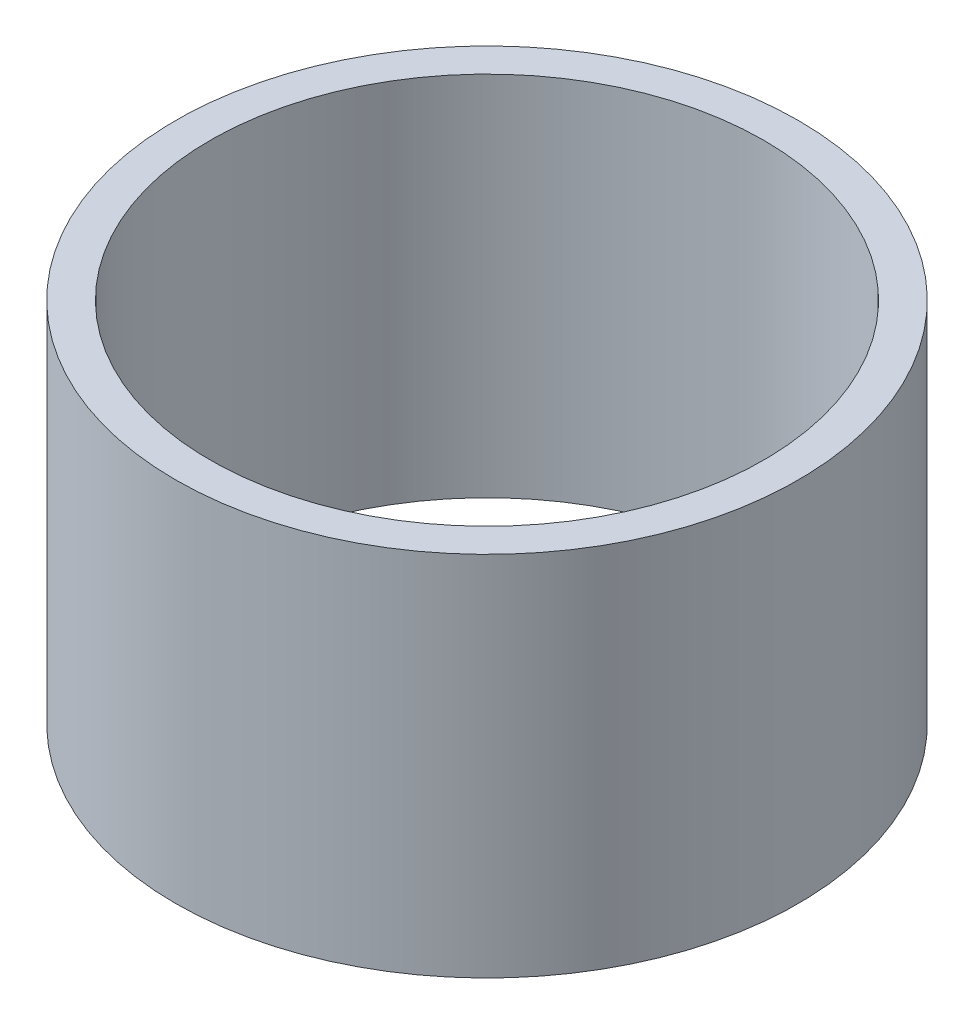
ISO-10303-21;
HEADER;
FILE_DESCRIPTION(('STEP AP214'),'2;1');
FILE_NAME('part.step','',(''),(''),'','','');
FILE_SCHEMA(('AUTOMOTIVE_DESIGN { 1 0 10303 214 1 1 1 1 }'));
ENDSEC;
DATA;
#1=APPLICATION_CONTEXT('core data for automotive mechanical design processes');
#2=APPLICATION_PROTOCOL_DEFINITION('international standard','automotive_design',2000,#1);
#3=PRODUCT_CONTEXT('',#1,'mechanical');
#4=PRODUCT('Part','Part','',(#3));
#5=PRODUCT_RELATED_PRODUCT_CATEGORY('part','',(#4));
#6=PRODUCT_DEFINITION_FORMATION('','',#4);
#7=PRODUCT_DEFINITION_CONTEXT('part definition',#1,'design');
#8=PRODUCT_DEFINITION('design','',#6,#7);
#9=PRODUCT_DEFINITION_SHAPE('','',#8);
#10=(LENGTH_UNIT() NAMED_UNIT(*) SI_UNIT(.MILLI.,.METRE.));
#11=(NAMED_UNIT(*) PLANE_ANGLE_UNIT() SI_UNIT($,.RADIAN.));
#12=(NAMED_UNIT(*) SI_UNIT($,.STERADIAN.) SOLID_ANGLE_UNIT());
#13=UNCERTAINTY_MEASURE_WITH_UNIT(LENGTH_MEASURE(1.E-05),#10,'distance_accuracy_value','');
#14=(GEOMETRIC_REPRESENTATION_CONTEXT(3) GLOBAL_UNCERTAINTY_ASSIGNED_CONTEXT((#13)) GLOBAL_UNIT_ASSIGNED_CONTEXT((#10,
#11,#12)) REPRESENTATION_CONTEXT('',''));
#15=CARTESIAN_POINT('',(0.,0.,0.));
#16=DIRECTION('',(0.,0.,1.));
#17=DIRECTION('',(1.,0.,0.));
#18=AXIS2_PLACEMENT_3D('',#15,#16,#17);
#19=CARTESIAN_POINT('',(0.,58.9221711094004,0.));
#20=DIRECTION('',(0.,-1.,0.));
#21=DIRECTION('',(0.,0.,-1.));
#22=AXIS2_PLACEMENT_3D('',#19,#20,#21);
#23=CYLINDRICAL_SURFACE('',#22,50.);
#24=CARTESIAN_POINT('',(0.,58.9221711094004,0.));
#25=DIRECTION('',(0.,1.,0.));
#26=DIRECTION('',(0.,0.,1.));
#27=AXIS2_PLACEMENT_3D('',#24,#25,#26);
#28=CIRCLE('',#27,50.);
#29=CARTESIAN_POINT('',(0.,58.9221711094004,-50.));
#30=VERTEX_POINT('',#29);
#31=EDGE_CURVE('E10',#30,#30,#28,.T.);
#32=CARTESIAN_POINT('',(0.,0.,0.));
#33=DIRECTION('',(0.,1.,0.));
#34=DIRECTION('',(0.,0.,1.));
#35=AXIS2_PLACEMENT_3D('',#32,#33,#34);
#36=CIRCLE('',#35,50.);
#37=CARTESIAN_POINT('',(0.,0.,-50.));
#38=VERTEX_POINT('',#37);
#39=EDGE_CURVE('E37',#38,#38,#36,.T.);
#40=CARTESIAN_POINT('',(0.,58.9221711094004,-50.));
#41=CARTESIAN_POINT('',(0.,58.3083984936774,-50.));
#42=CARTESIAN_POINT('',(0.,57.6946258779545,-50.));
#43=CARTESIAN_POINT('',(0.,56.4670806465087,-50.));
#44=CARTESIAN_POINT('',(0.,55.8533080307858,-50.));
#45=CARTESIAN_POINT('',(0.,54.6257627993399,-50.));
#46=CARTESIAN_POINT('',(0.,54.011990183617,-50.));
#47=CARTESIAN_POINT('',(0.,52.7844449521712,-50.));
#48=CARTESIAN_POINT('',(0.,52.1706723364482,-50.));
#49=CARTESIAN_POINT('',(0.,50.9431271050024,-50.));
#50=CARTESIAN_POINT('',(0.,50.3293544892795,-50.));
#51=CARTESIAN_POINT('',(0.,49.1018092578336,-50.));
#52=CARTESIAN_POINT('',(0.,48.4880366421107,-50.));
#53=CARTESIAN_POINT('',(0.,47.2604914106649,-50.));
#54=CARTESIAN_POINT('',(0.,46.646718794942,-50.));
#55=CARTESIAN_POINT('',(0.,45.4191735634961,-50.));
#56=CARTESIAN_POINT('',(0.,44.8054009477732,-50.));
#57=CARTESIAN_POINT('',(0.,43.5778557163273,-50.));
#58=CARTESIAN_POINT('',(0.,42.9640831006044,-50.));
#59=CARTESIAN_POINT('',(0.,41.7365378691586,-50.));
#60=CARTESIAN_POINT('',(0.,41.1227652534357,-50.));
#61=CARTESIAN_POINT('',(0.,39.8952200219898,-50.));
#62=CARTESIAN_POINT('',(0.,39.2814474062669,-50.));
#63=CARTESIAN_POINT('',(0.,38.0539021748211,-50.));
#64=CARTESIAN_POINT('',(0.,37.4401295590982,-50.));
#65=CARTESIAN_POINT('',(0.,36.2125843276523,-50.));
#66=CARTESIAN_POINT('',(0.,35.5988117119294,-50.));
#67=CARTESIAN_POINT('',(0.,34.3712664804835,-50.));
#68=CARTESIAN_POINT('',(0.,33.7574938647606,-50.));
#69=CARTESIAN_POINT('',(0.,32.5299486333148,-50.));
#70=CARTESIAN_POINT('',(0.,31.9161760175919,-50.));
#71=CARTESIAN_POINT('',(0.,30.688630786146,-50.));
#72=CARTESIAN_POINT('',(0.,30.0748581704231,-50.));
#73=CARTESIAN_POINT('',(0.,28.8473129389773,-50.));
#74=CARTESIAN_POINT('',(0.,28.2335403232543,-50.));
#75=CARTESIAN_POINT('',(0.,27.0059950918085,-50.));
#76=CARTESIAN_POINT('',(0.,26.3922224760856,-50.));
#77=CARTESIAN_POINT('',(0.,25.1646772446397,-50.));
#78=CARTESIAN_POINT('',(0.,24.5509046289168,-50.));
#79=CARTESIAN_POINT('',(0.,23.323359397471,-50.));
#80=CARTESIAN_POINT('',(0.,22.7095867817481,-50.));
#81=CARTESIAN_POINT('',(0.,21.4820415503022,-50.));
#82=CARTESIAN_POINT('',(0.,20.8682689345793,-50.));
#83=CARTESIAN_POINT('',(0.,19.6407237031335,-50.));
#84=CARTESIAN_POINT('',(0.,19.0269510874105,-50.));
#85=CARTESIAN_POINT('',(0.,17.7994058559647,-50.));
#86=CARTESIAN_POINT('',(0.,17.1856332402418,-50.));
#87=CARTESIAN_POINT('',(0.,15.9580880087959,-50.));
#88=CARTESIAN_POINT('',(0.,15.344315393073,-50.));
#89=CARTESIAN_POINT('',(0.,14.1167701616272,-50.));
#90=CARTESIAN_POINT('',(0.,13.5029975459043,-50.));
#91=CARTESIAN_POINT('',(0.,12.2754523144584,-50.));
#92=CARTESIAN_POINT('',(0.,11.6616796987355,-50.));
#93=CARTESIAN_POINT('',(0.,10.4341344672897,-50.));
#94=CARTESIAN_POINT('',(0.,9.82036185156673,-50.));
#95=CARTESIAN_POINT('',(0.,8.59281662012089,-50.));
#96=CARTESIAN_POINT('',(0.,7.97904400439797,-50.));
#97=CARTESIAN_POINT('',(0.,6.75149877295212,-50.));
#98=CARTESIAN_POINT('',(0.,6.1377261572292,-50.));
#99=CARTESIAN_POINT('',(0.,4.91018092578336,-50.));
#100=CARTESIAN_POINT('',(0.,4.29640831006044,-50.));
#101=CARTESIAN_POINT('',(0.,3.0688630786146,-50.));
#102=CARTESIAN_POINT('',(0.,2.45509046289168,-50.));
#103=CARTESIAN_POINT('',(0.,1.22754523144584,-50.));
#104=CARTESIAN_POINT('',(0.,0.61377261572292,-50.));
#105=CARTESIAN_POINT('',(0.,0.,-50.));
#106=B_SPLINE_CURVE_WITH_KNOTS('',3,(#40,#41,#42,#43,#44,#45,#46,#47,#48,#49,#50,#51,#52,#53,
#54,#55,#56,#57,#58,#59,#60,#61,#62,#63,#64,#65,#66,#67,#68,#69,#70,#71,#72,#73,#74,#75,#76,#77,
#78,#79,#80,#81,#82,#83,#84,#85,#86,#87,#88,#89,#90,#91,#92,#93,#94,#95,#96,#97,#98,#99,#100,
#101,#102,#103,#104,#105),.UNSPECIFIED.,.F.,.F.,(4,2,2,2,2,2,2,2,2,2,2,2,2,2,2,2,2,2,2,2,2,2,2,
2,2,2,2,2,2,2,2,2,4),(0.,1.84131784716877,3.68263569433753,5.52395354150629,7.36527138867505,
9.20658923584381,11.0479070830126,12.8892249301813,14.7305427773501,16.5718606245189,
18.4131784716876,20.2544963188564,22.0958141660251,23.9371320131939,25.7784498603627,
27.6197677075314,29.4610855547002,31.3024034018689,33.1437212490377,34.9850390962065,
36.8263569433752,38.667674790544,40.5089926377128,42.3503104848815,44.1916283320503,
46.032946179219,47.8742640263878,49.7155818735566,51.5568997207253,53.3982175678941,
55.2395354150628,57.0808532622316,58.9221711094004),.UNSPECIFIED.);
#107=EDGE_CURVE('BSEAM40',#30,#38,#106,.T.);
#108=ORIENTED_EDGE('',*,*,#31,.F.);
#109=ORIENTED_EDGE('',*,*,#39,.T.);
#110=ORIENTED_EDGE('',*,*,#107,.T.);
#111=ORIENTED_EDGE('',*,*,#107,.F.);
#112=EDGE_LOOP('',(#108,#110,#109,#111));
#113=FACE_BOUND('',#112,.T.);
#114=ADVANCED_FACE('F40',(#113),#23,.T.);
#115=CARTESIAN_POINT('',(0.,58.9221711094004,0.));
#116=DIRECTION('',(0.,1.,0.));
#117=DIRECTION('',(0.,0.,1.));
#118=AXIS2_PLACEMENT_3D('',#115,#116,#117);
#119=PLANE('',#118);
#120=CARTESIAN_POINT('',(0.,58.9221711094004,0.));
#121=DIRECTION('',(0.,1.,0.));
#122=DIRECTION('',(0.,0.,1.));
#123=AXIS2_PLACEMENT_3D('',#120,#121,#122);
#124=CIRCLE('',#123,44.4688690733831);
#125=CARTESIAN_POINT('',(0.,58.9221711094004,-44.4688690733831));
#126=VERTEX_POINT('',#125);
#127=EDGE_CURVE('E50',#126,#126,#124,.T.);
#128=ORIENTED_EDGE('',*,*,#127,.F.);
#129=EDGE_LOOP('',(#128));
#130=FACE_BOUND('',#129,.T.);
#131=ORIENTED_EDGE('',*,*,#31,.T.);
#132=EDGE_LOOP('',(#131));
#133=FACE_BOUND('',#132,.T.);
#134=ADVANCED_FACE('F59',(#130,#133),#119,.T.);
#135=CARTESIAN_POINT('',(0.,0.,0.));
#136=DIRECTION('',(0.,1.,0.));
#137=DIRECTION('',(0.,0.,1.));
#138=AXIS2_PLACEMENT_3D('',#135,#136,#137);
#139=PLANE('',#138);
#140=CARTESIAN_POINT('',(0.,0.,0.));
#141=DIRECTION('',(0.,1.,0.));
#142=DIRECTION('',(0.,0.,1.));
#143=AXIS2_PLACEMENT_3D('',#140,#141,#142);
#144=CIRCLE('',#143,44.4688690733831);
#145=CARTESIAN_POINT('',(0.,0.,-44.4688690733831));
#146=VERTEX_POINT('',#145);
#147=EDGE_CURVE('E47',#146,#146,#144,.T.);
#148=ORIENTED_EDGE('',*,*,#147,.T.);
#149=EDGE_LOOP('',(#148));
#150=FACE_BOUND('',#149,.T.);
#151=ORIENTED_EDGE('',*,*,#39,.F.);
#152=EDGE_LOOP('',(#151));
#153=FACE_BOUND('',#152,.T.);
#154=ADVANCED_FACE('F58',(#150,#153),#139,.F.);
#155=CARTESIAN_POINT('',(0.,58.9221711094004,0.));
#156=DIRECTION('',(0.,-1.,0.));
#157=DIRECTION('',(0.,0.,-1.));
#158=AXIS2_PLACEMENT_3D('',#155,#156,#157);
#159=CYLINDRICAL_SURFACE('',#158,44.4688690733831);
#160=CARTESIAN_POINT('',(0.,58.9221711094004,-44.4688690733831));
#161=CARTESIAN_POINT('',(0.,58.3083984936774,-44.4688690733831));
#162=CARTESIAN_POINT('',(0.,57.6946258779545,-44.4688690733831));
#163=CARTESIAN_POINT('',(0.,56.4670806465087,-44.4688690733831));
#164=CARTESIAN_POINT('',(0.,55.8533080307858,-44.4688690733831));
#165=CARTESIAN_POINT('',(0.,54.6257627993399,-44.4688690733831));
#166=CARTESIAN_POINT('',(0.,54.011990183617,-44.4688690733831));
#167=CARTESIAN_POINT('',(0.,52.7844449521712,-44.4688690733831));
#168=CARTESIAN_POINT('',(0.,52.1706723364482,-44.4688690733831));
#169=CARTESIAN_POINT('',(0.,50.9431271050024,-44.4688690733831));
#170=CARTESIAN_POINT('',(0.,50.3293544892795,-44.4688690733831));
#171=CARTESIAN_POINT('',(0.,49.1018092578336,-44.4688690733831));
#172=CARTESIAN_POINT('',(0.,48.4880366421107,-44.4688690733831));
#173=CARTESIAN_POINT('',(0.,47.2604914106649,-44.4688690733831));
#174=CARTESIAN_POINT('',(0.,46.646718794942,-44.4688690733831));
#175=CARTESIAN_POINT('',(0.,45.4191735634961,-44.4688690733831));
#176=CARTESIAN_POINT('',(0.,44.8054009477732,-44.4688690733831));
#177=CARTESIAN_POINT('',(0.,43.5778557163273,-44.4688690733831));
#178=CARTESIAN_POINT('',(0.,42.9640831006044,-44.4688690733831));
#179=CARTESIAN_POINT('',(0.,41.7365378691586,-44.4688690733831));
#180=CARTESIAN_POINT('',(0.,41.1227652534357,-44.4688690733831));
#181=CARTESIAN_POINT('',(0.,39.8952200219898,-44.4688690733831));
#182=CARTESIAN_POINT('',(0.,39.2814474062669,-44.4688690733831));
#183=CARTESIAN_POINT('',(0.,38.0539021748211,-44.4688690733831));
#184=CARTESIAN_POINT('',(0.,37.4401295590982,-44.4688690733831));
#185=CARTESIAN_POINT('',(0.,36.2125843276523,-44.4688690733831));
#186=CARTESIAN_POINT('',(0.,35.5988117119294,-44.4688690733831));
#187=CARTESIAN_POINT('',(0.,34.3712664804835,-44.4688690733831));
#188=CARTESIAN_POINT('',(0.,33.7574938647606,-44.4688690733831));
#189=CARTESIAN_POINT('',(0.,32.5299486333148,-44.4688690733831));
#190=CARTESIAN_POINT('',(0.,31.9161760175919,-44.4688690733831));
#191=CARTESIAN_POINT('',(0.,30.688630786146,-44.4688690733831));
#192=CARTESIAN_POINT('',(0.,30.0748581704231,-44.4688690733831));
#193=CARTESIAN_POINT('',(0.,28.8473129389773,-44.4688690733831));
#194=CARTESIAN_POINT('',(0.,28.2335403232543,-44.4688690733831));
#195=CARTESIAN_POINT('',(0.,27.0059950918085,-44.4688690733831));
#196=CARTESIAN_POINT('',(0.,26.3922224760856,-44.4688690733831));
#197=CARTESIAN_POINT('',(0.,25.1646772446397,-44.4688690733831));
#198=CARTESIAN_POINT('',(0.,24.5509046289168,-44.4688690733831));
#199=CARTESIAN_POINT('',(0.,23.323359397471,-44.4688690733831));
#200=CARTESIAN_POINT('',(0.,22.7095867817481,-44.4688690733831));
#201=CARTESIAN_POINT('',(0.,21.4820415503022,-44.4688690733831));
#202=CARTESIAN_POINT('',(0.,20.8682689345793,-44.4688690733831));
#203=CARTESIAN_POINT('',(0.,19.6407237031335,-44.4688690733831));
#204=CARTESIAN_POINT('',(0.,19.0269510874105,-44.4688690733831));
#205=CARTESIAN_POINT('',(0.,17.7994058559647,-44.4688690733831));
#206=CARTESIAN_POINT('',(0.,17.1856332402418,-44.4688690733831));
#207=CARTESIAN_POINT('',(0.,15.9580880087959,-44.4688690733831));
#208=CARTESIAN_POINT('',(0.,15.344315393073,-44.4688690733831));
#209=CARTESIAN_POINT('',(0.,14.1167701616272,-44.4688690733831));
#210=CARTESIAN_POINT('',(0.,13.5029975459043,-44.4688690733831));
#211=CARTESIAN_POINT('',(0.,12.2754523144584,-44.4688690733831));
#212=CARTESIAN_POINT('',(0.,11.6616796987355,-44.4688690733831));
#213=CARTESIAN_POINT('',(0.,10.4341344672897,-44.4688690733831));
#214=CARTESIAN_POINT('',(0.,9.82036185156673,-44.4688690733831));
#215=CARTESIAN_POINT('',(0.,8.59281662012089,-44.4688690733831));
#216=CARTESIAN_POINT('',(0.,7.97904400439797,-44.4688690733831));
#217=CARTESIAN_POINT('',(0.,6.75149877295212,-44.4688690733831));
#218=CARTESIAN_POINT('',(0.,6.1377261572292,-44.4688690733831));
#219=CARTESIAN_POINT('',(0.,4.91018092578336,-44.4688690733831));
#220=CARTESIAN_POINT('',(0.,4.29640831006044,-44.4688690733831));
#221=CARTESIAN_POINT('',(0.,3.0688630786146,-44.4688690733831));
#222=CARTESIAN_POINT('',(0.,2.45509046289168,-44.4688690733831));
#223=CARTESIAN_POINT('',(0.,1.22754523144584,-44.4688690733831));
#224=CARTESIAN_POINT('',(0.,0.61377261572292,-44.4688690733831));
#225=CARTESIAN_POINT('',(0.,0.,-44.4688690733831));
#226=B_SPLINE_CURVE_WITH_KNOTS('',3,(#160,#161,#162,#163,#164,#165,#166,#167,#168,#169,#170,
#171,#172,#173,#174,#175,#176,#177,#178,#179,#180,#181,#182,#183,#184,#185,#186,#187,#188,#189,
#190,#191,#192,#193,#194,#195,#196,#197,#198,#199,#200,#201,#202,#203,#204,#205,#206,#207,#208,
#209,#210,#211,#212,#213,#214,#215,#216,#217,#218,#219,#220,#221,#222,#223,#224,#225),
.UNSPECIFIED.,.F.,.F.,(4,2,2,2,2,2,2,2,2,2,2,2,2,2,2,2,2,2,2,2,2,2,2,2,2,2,2,2,2,2,2,2,4),(0.,
1.84131784716877,3.68263569433753,5.52395354150629,7.36527138867505,9.20658923584381,
11.0479070830126,12.8892249301813,14.7305427773501,16.5718606245189,18.4131784716876,
20.2544963188564,22.0958141660251,23.9371320131939,25.7784498603627,27.6197677075314,
29.4610855547002,31.3024034018689,33.1437212490377,34.9850390962065,36.8263569433752,
38.667674790544,40.5089926377128,42.3503104848815,44.1916283320503,46.032946179219,
47.8742640263878,49.7155818735566,51.5568997207253,53.3982175678941,55.2395354150628,
57.0808532622316,58.9221711094004),.UNSPECIFIED.);
#227=EDGE_CURVE('BSEAM54',#126,#146,#226,.T.);
#228=ORIENTED_EDGE('',*,*,#127,.T.);
#229=ORIENTED_EDGE('',*,*,#147,.F.);
#230=ORIENTED_EDGE('',*,*,#227,.T.);
#231=ORIENTED_EDGE('',*,*,#227,.F.);
#232=EDGE_LOOP('',(#228,#230,#229,#231));
#233=FACE_BOUND('',#232,.T.);
#234=ADVANCED_FACE('F54',(#233),#159,.F.);
#235=CLOSED_SHELL('',(#114,#134,#154,#234));
#236=MANIFOLD_SOLID_BREP('B2',#235);
#237=ADVANCED_BREP_SHAPE_REPRESENTATION('',(#18,#236),#14);
#238=SHAPE_DEFINITION_REPRESENTATION(#9,#237);
ENDSEC;
END-ISO-10303-21;
